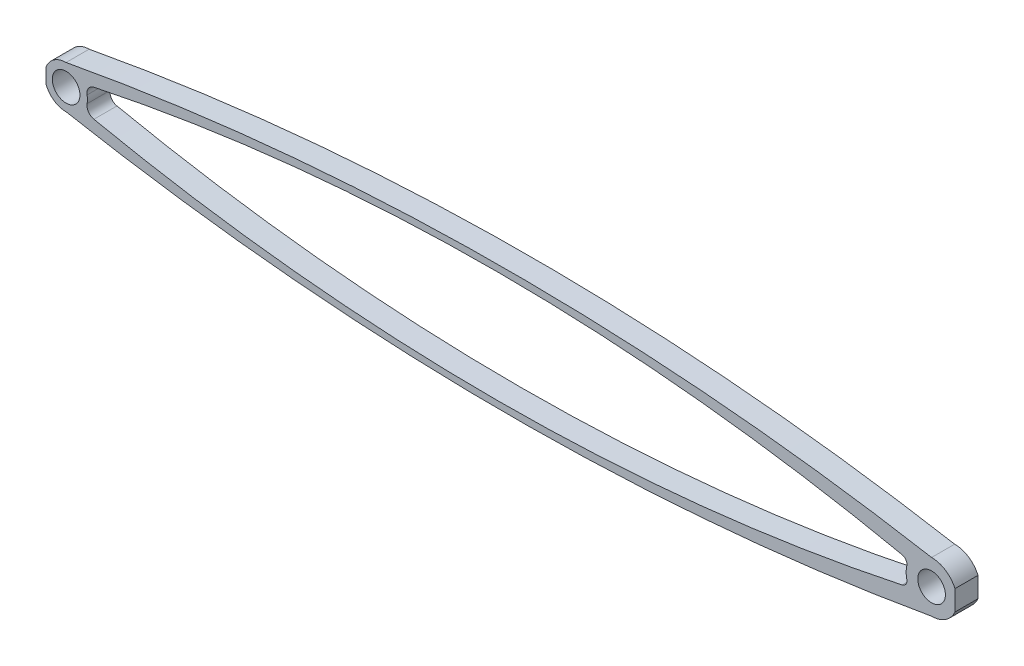
ISO-10303-21;
HEADER;
FILE_DESCRIPTION(('STEP AP214'),'2;1');
FILE_NAME('part.step','',(''),(''),'','','');
FILE_SCHEMA(('AUTOMOTIVE_DESIGN { 1 0 10303 214 1 1 1 1 }'));
ENDSEC;
DATA;
#1=APPLICATION_CONTEXT('core data for automotive mechanical design processes');
#2=APPLICATION_PROTOCOL_DEFINITION('international standard','automotive_design',2000,#1);
#3=PRODUCT_CONTEXT('',#1,'mechanical');
#4=PRODUCT('Part','Part','',(#3));
#5=PRODUCT_RELATED_PRODUCT_CATEGORY('part','',(#4));
#6=PRODUCT_DEFINITION_FORMATION('','',#4);
#7=PRODUCT_DEFINITION_CONTEXT('part definition',#1,'design');
#8=PRODUCT_DEFINITION('design','',#6,#7);
#9=PRODUCT_DEFINITION_SHAPE('','',#8);
#10=(LENGTH_UNIT() NAMED_UNIT(*) SI_UNIT(.MILLI.,.METRE.));
#11=(NAMED_UNIT(*) PLANE_ANGLE_UNIT() SI_UNIT($,.RADIAN.));
#12=(NAMED_UNIT(*) SI_UNIT($,.STERADIAN.) SOLID_ANGLE_UNIT());
#13=UNCERTAINTY_MEASURE_WITH_UNIT(LENGTH_MEASURE(1.E-05),#10,'distance_accuracy_value','');
#14=(GEOMETRIC_REPRESENTATION_CONTEXT(3) GLOBAL_UNCERTAINTY_ASSIGNED_CONTEXT((#13)) GLOBAL_UNIT_ASSIGNED_CONTEXT((#10,
#11,#12)) REPRESENTATION_CONTEXT('',''));
#15=CARTESIAN_POINT('',(0.,0.,0.));
#16=DIRECTION('',(0.,0.,1.));
#17=DIRECTION('',(1.,0.,0.));
#18=AXIS2_PLACEMENT_3D('',#15,#16,#17);
#19=CARTESIAN_POINT('',(0.,0.,5.));
#20=DIRECTION('',(0.,0.,1.));
#21=DIRECTION('',(1.,0.,0.));
#22=AXIS2_PLACEMENT_3D('',#19,#20,#21);
#23=PLANE('',#22);
#24=CARTESIAN_POINT('',(181.075647956683,-1.53844641665199,5.));
#25=DIRECTION('',(0.,0.,1.));
#26=DIRECTION('',(1.,0.,0.));
#27=AXIS2_PLACEMENT_3D('',#24,#25,#26);
#28=CIRCLE('',#27,1.33882745908539);
#29=CARTESIAN_POINT('',(181.3534915169,-2.84812650020144,5.));
#30=VERTEX_POINT('',#29);
#31=CARTESIAN_POINT('',(182.380388165267,-1.23825988579893,5.));
#32=VERTEX_POINT('',#31);
#33=EDGE_CURVE('E226',#30,#32,#28,.T.);
#34=ORIENTED_EDGE('',*,*,#33,.F.);
#35=CARTESIAN_POINT('',(93.3034744992683,412.196057190972,5.));
#36=DIRECTION('',(0.,0.,1.));
#37=DIRECTION('',(1.,0.,0.));
#38=AXIS2_PLACEMENT_3D('',#35,#36,#37);
#39=CIRCLE('',#38,424.281133109496);
#40=CARTESIAN_POINT('',(6.03518102050062,-3.01319712061177,5.));
#41=VERTEX_POINT('',#40);
#42=EDGE_CURVE('E224',#30,#41,#39,.F.);
#43=ORIENTED_EDGE('',*,*,#42,.T.);
#44=CARTESIAN_POINT('',(6.42461858925253,-1.16031245796236,5.));
#45=DIRECTION('',(0.,0.,1.));
#46=DIRECTION('',(1.,0.,0.));
#47=AXIS2_PLACEMENT_3D('',#44,#45,#46);
#48=CIRCLE('',#47,1.89336821380188);
#49=CARTESIAN_POINT('',(4.56139373102548,-0.823806409400569,5.));
#50=VERTEX_POINT('',#49);
#51=EDGE_CURVE('E221',#50,#41,#48,.T.);
#52=ORIENTED_EDGE('',*,*,#51,.F.);
#53=CARTESIAN_POINT('',(0.,0.,5.));
#54=DIRECTION('',(0.,0.,1.));
#55=DIRECTION('',(1.,0.,0.));
#56=AXIS2_PLACEMENT_3D('',#53,#54,#55);
#57=CIRCLE('',#56,4.63518821296482);
#58=CARTESIAN_POINT('',(4.56139373102548,0.823806409400569,5.));
#59=VERTEX_POINT('',#58);
#60=EDGE_CURVE('E219',#50,#59,#57,.T.);
#61=ORIENTED_EDGE('',*,*,#60,.T.);
#62=CARTESIAN_POINT('',(6.42461858925253,1.16031245796236,5.));
#63=DIRECTION('',(0.,0.,1.));
#64=DIRECTION('',(1.,0.,0.));
#65=AXIS2_PLACEMENT_3D('',#62,#63,#64);
#66=CIRCLE('',#65,1.89336821380188);
#67=CARTESIAN_POINT('',(6.03518102050062,3.01319712061177,5.));
#68=VERTEX_POINT('',#67);
#69=EDGE_CURVE('E217',#59,#68,#66,.F.);
#70=ORIENTED_EDGE('',*,*,#69,.T.);
#71=CARTESIAN_POINT('',(93.3034744992683,-412.196057190972,5.));
#72=DIRECTION('',(0.,0.,1.));
#73=DIRECTION('',(1.,0.,0.));
#74=AXIS2_PLACEMENT_3D('',#71,#72,#73);
#75=CIRCLE('',#74,424.281133109496);
#76=CARTESIAN_POINT('',(181.3534915169,2.84812650020144,5.));
#77=VERTEX_POINT('',#76);
#78=EDGE_CURVE('E214',#77,#68,#75,.T.);
#79=ORIENTED_EDGE('',*,*,#78,.F.);
#80=CARTESIAN_POINT('',(181.075647956683,1.53844641665199,5.));
#81=DIRECTION('',(0.,0.,1.));
#82=DIRECTION('',(1.,0.,0.));
#83=AXIS2_PLACEMENT_3D('',#80,#81,#82);
#84=CIRCLE('',#83,1.33882745908539);
#85=CARTESIAN_POINT('',(182.380388165267,1.23825988579893,5.));
#86=VERTEX_POINT('',#85);
#87=EDGE_CURVE('E212',#77,#86,#84,.F.);
#88=ORIENTED_EDGE('',*,*,#87,.T.);
#89=CARTESIAN_POINT('',(187.7624,0.,5.));
#90=DIRECTION('',(0.,0.,1.));
#91=DIRECTION('',(1.,0.,0.));
#92=AXIS2_PLACEMENT_3D('',#89,#90,#91);
#93=CIRCLE('',#92,5.52262065816452);
#94=EDGE_CURVE('E210',#86,#32,#93,.T.);
#95=ORIENTED_EDGE('',*,*,#94,.T.);
#96=EDGE_LOOP('',(#34,#43,#52,#61,#70,#79,#88,#95));
#97=FACE_BOUND('',#96,.T.);
#98=CARTESIAN_POINT('',(0.,0.,5.));
#99=DIRECTION('',(0.,0.,1.));
#100=DIRECTION('',(1.,0.,0.));
#101=AXIS2_PLACEMENT_3D('',#98,#99,#100);
#102=CIRCLE('',#101,3.00000007924961);
#103=CARTESIAN_POINT('',(3.00000007924961,0.,5.));
#104=VERTEX_POINT('',#103);
#105=EDGE_CURVE('E197',#104,#104,#102,.T.);
#106=ORIENTED_EDGE('',*,*,#105,.F.);
#107=EDGE_LOOP('',(#106));
#108=FACE_BOUND('',#107,.T.);
#109=CARTESIAN_POINT('',(187.7624,0.,5.));
#110=DIRECTION('',(0.,0.,1.));
#111=DIRECTION('',(1.,0.,0.));
#112=AXIS2_PLACEMENT_3D('',#109,#110,#111);
#113=CIRCLE('',#112,3.00000007924962);
#114=CARTESIAN_POINT('',(190.76240007925,0.,5.));
#115=VERTEX_POINT('',#114);
#116=EDGE_CURVE('E193',#115,#115,#113,.T.);
#117=ORIENTED_EDGE('',*,*,#116,.F.);
#118=EDGE_LOOP('',(#117));
#119=FACE_BOUND('',#118,.T.);
#120=CARTESIAN_POINT('',(0.,4.63518821296482,5.));
#121=VERTEX_POINT('',#120);
#122=CARTESIAN_POINT('',(-4.35681947691644,1.58211687784739,5.));
#123=VERTEX_POINT('',#122);
#124=EDGE_CURVE('E200',#121,#123,#57,.T.);
#125=ORIENTED_EDGE('',*,*,#124,.T.);
#126=DIRECTION('',(0.,1.,0.));
#127=VECTOR('',#126,1.);
#128=CARTESIAN_POINT('',(-4.35681947691644,0.,5.));
#129=LINE('',#128,#127);
#130=CARTESIAN_POINT('',(-4.35681947691644,-1.58211687784739,5.));
#131=VERTEX_POINT('',#130);
#132=EDGE_CURVE('E148',#131,#123,#129,.T.);
#133=ORIENTED_EDGE('',*,*,#132,.F.);
#134=CARTESIAN_POINT('',(0.,-4.63518821296482,5.));
#135=VERTEX_POINT('',#134);
#136=EDGE_CURVE('E204',#131,#135,#57,.T.);
#137=ORIENTED_EDGE('',*,*,#136,.T.);
#138=CARTESIAN_POINT('',(96.3223446094582,511.41694051381,5.));
#139=DIRECTION('',(0.,0.,1.));
#140=DIRECTION('',(1.,0.,0.));
#141=AXIS2_PLACEMENT_3D('',#138,#139,#140);
#142=CIRCLE('',#141,524.964564170286);
#143=CARTESIAN_POINT('',(187.7624,-5.52262065816452,5.));
#144=VERTEX_POINT('',#143);
#145=EDGE_CURVE('E206',#144,#135,#142,.F.);
#146=ORIENTED_EDGE('',*,*,#145,.F.);
#147=CARTESIAN_POINT('',(192.829341952088,-2.19668800428204,5.));
#148=VERTEX_POINT('',#147);
#149=EDGE_CURVE('E205',#144,#148,#93,.T.);
#150=ORIENTED_EDGE('',*,*,#149,.T.);
#151=DIRECTION('',(0.,-1.,0.));
#152=VECTOR('',#151,1.);
#153=CARTESIAN_POINT('',(192.829341952088,0.,5.));
#154=LINE('',#153,#152);
#155=CARTESIAN_POINT('',(192.829341952088,2.19668800428204,5.));
#156=VERTEX_POINT('',#155);
#157=EDGE_CURVE('E232',#156,#148,#154,.T.);
#158=ORIENTED_EDGE('',*,*,#157,.F.);
#159=CARTESIAN_POINT('',(187.7624,5.52262065816452,5.));
#160=VERTEX_POINT('',#159);
#161=EDGE_CURVE('E209',#156,#160,#93,.T.);
#162=ORIENTED_EDGE('',*,*,#161,.T.);
#163=CARTESIAN_POINT('',(96.3223446094582,-511.41694051381,5.));
#164=DIRECTION('',(0.,0.,1.));
#165=DIRECTION('',(1.,0.,0.));
#166=AXIS2_PLACEMENT_3D('',#163,#164,#165);
#167=CIRCLE('',#166,524.964564170286);
#168=EDGE_CURVE('E201',#160,#121,#167,.T.);
#169=ORIENTED_EDGE('',*,*,#168,.T.);
#170=EDGE_LOOP('',(#125,#133,#137,#146,#150,#158,#162,#169));
#171=FACE_BOUND('',#170,.T.);
#172=ADVANCED_FACE('F36',(#97,#108,#119,#171),#23,.T.);
#173=CARTESIAN_POINT('',(0.,0.,0.));
#174=DIRECTION('',(0.,0.,1.));
#175=DIRECTION('',(1.,0.,0.));
#176=AXIS2_PLACEMENT_3D('',#173,#174,#175);
#177=PLANE('',#176);
#178=CARTESIAN_POINT('',(181.075647956683,-1.53844641665199,0.));
#179=DIRECTION('',(0.,0.,1.));
#180=DIRECTION('',(1.,0.,0.));
#181=AXIS2_PLACEMENT_3D('',#178,#179,#180);
#182=CIRCLE('',#181,1.33882745908539);
#183=CARTESIAN_POINT('',(181.3534915169,-2.84812650020144,0.));
#184=VERTEX_POINT('',#183);
#185=CARTESIAN_POINT('',(182.380388165267,-1.23825988579893,0.));
#186=VERTEX_POINT('',#185);
#187=EDGE_CURVE('E188',#184,#186,#182,.T.);
#188=ORIENTED_EDGE('',*,*,#187,.T.);
#189=CARTESIAN_POINT('',(187.7624,0.,0.));
#190=DIRECTION('',(0.,0.,1.));
#191=DIRECTION('',(1.,0.,0.));
#192=AXIS2_PLACEMENT_3D('',#189,#190,#191);
#193=CIRCLE('',#192,5.52262065816452);
#194=CARTESIAN_POINT('',(182.380388165267,1.23825988579893,0.));
#195=VERTEX_POINT('',#194);
#196=EDGE_CURVE('E291',#195,#186,#193,.T.);
#197=ORIENTED_EDGE('',*,*,#196,.F.);
#198=CARTESIAN_POINT('',(181.075647956683,1.53844641665199,0.));
#199=DIRECTION('',(0.,0.,1.));
#200=DIRECTION('',(1.,0.,0.));
#201=AXIS2_PLACEMENT_3D('',#198,#199,#200);
#202=CIRCLE('',#201,1.33882745908539);
#203=CARTESIAN_POINT('',(181.3534915169,2.84812650020144,0.));
#204=VERTEX_POINT('',#203);
#205=EDGE_CURVE('E296',#204,#195,#202,.F.);
#206=ORIENTED_EDGE('',*,*,#205,.F.);
#207=CARTESIAN_POINT('',(93.3034744992683,-412.196057190972,0.));
#208=DIRECTION('',(0.,0.,1.));
#209=DIRECTION('',(1.,0.,0.));
#210=AXIS2_PLACEMENT_3D('',#207,#208,#209);
#211=CIRCLE('',#210,424.281133109496);
#212=CARTESIAN_POINT('',(6.03518102050062,3.01319712061177,0.));
#213=VERTEX_POINT('',#212);
#214=EDGE_CURVE('E181',#204,#213,#211,.T.);
#215=ORIENTED_EDGE('',*,*,#214,.T.);
#216=CARTESIAN_POINT('',(6.42461858925253,1.16031245796236,0.));
#217=DIRECTION('',(0.,0.,1.));
#218=DIRECTION('',(1.,0.,0.));
#219=AXIS2_PLACEMENT_3D('',#216,#217,#218);
#220=CIRCLE('',#219,1.89336821380188);
#221=CARTESIAN_POINT('',(4.56139373102548,0.823806409400569,0.));
#222=VERTEX_POINT('',#221);
#223=EDGE_CURVE('E174',#222,#213,#220,.F.);
#224=ORIENTED_EDGE('',*,*,#223,.F.);
#225=CARTESIAN_POINT('',(0.,0.,0.));
#226=DIRECTION('',(0.,0.,1.));
#227=DIRECTION('',(1.,0.,0.));
#228=AXIS2_PLACEMENT_3D('',#225,#226,#227);
#229=CIRCLE('',#228,4.63518821296482);
#230=CARTESIAN_POINT('',(4.56139373102548,-0.823806409400569,0.));
#231=VERTEX_POINT('',#230);
#232=EDGE_CURVE('E167',#231,#222,#229,.T.);
#233=ORIENTED_EDGE('',*,*,#232,.F.);
#234=CARTESIAN_POINT('',(6.42461858925253,-1.16031245796236,0.));
#235=DIRECTION('',(0.,0.,1.));
#236=DIRECTION('',(1.,0.,0.));
#237=AXIS2_PLACEMENT_3D('',#234,#235,#236);
#238=CIRCLE('',#237,1.89336821380188);
#239=CARTESIAN_POINT('',(6.03518102050062,-3.01319712061177,0.));
#240=VERTEX_POINT('',#239);
#241=EDGE_CURVE('E175',#231,#240,#238,.T.);
#242=ORIENTED_EDGE('',*,*,#241,.T.);
#243=CARTESIAN_POINT('',(93.3034744992683,412.196057190972,0.));
#244=DIRECTION('',(0.,0.,1.));
#245=DIRECTION('',(1.,0.,0.));
#246=AXIS2_PLACEMENT_3D('',#243,#244,#245);
#247=CIRCLE('',#246,424.281133109496);
#248=EDGE_CURVE('E183',#184,#240,#247,.F.);
#249=ORIENTED_EDGE('',*,*,#248,.F.);
#250=EDGE_LOOP('',(#188,#197,#206,#215,#224,#233,#242,#249));
#251=FACE_BOUND('',#250,.T.);
#252=CARTESIAN_POINT('',(0.,0.,0.));
#253=DIRECTION('',(0.,0.,1.));
#254=DIRECTION('',(1.,0.,0.));
#255=AXIS2_PLACEMENT_3D('',#252,#253,#254);
#256=CIRCLE('',#255,3.00000007924961);
#257=CARTESIAN_POINT('',(3.00000007924961,0.,0.));
#258=VERTEX_POINT('',#257);
#259=EDGE_CURVE('E165',#258,#258,#256,.T.);
#260=ORIENTED_EDGE('',*,*,#259,.T.);
#261=EDGE_LOOP('',(#260));
#262=FACE_BOUND('',#261,.T.);
#263=CARTESIAN_POINT('',(187.7624,0.,0.));
#264=DIRECTION('',(0.,0.,1.));
#265=DIRECTION('',(1.,0.,0.));
#266=AXIS2_PLACEMENT_3D('',#263,#264,#265);
#267=CIRCLE('',#266,3.00000007924962);
#268=CARTESIAN_POINT('',(190.76240007925,0.,0.));
#269=VERTEX_POINT('',#268);
#270=EDGE_CURVE('E169',#269,#269,#267,.T.);
#271=ORIENTED_EDGE('',*,*,#270,.T.);
#272=EDGE_LOOP('',(#271));
#273=FACE_BOUND('',#272,.T.);
#274=DIRECTION('',(0.,1.,0.));
#275=VECTOR('',#274,1.);
#276=CARTESIAN_POINT('',(-4.35681947691644,0.,0.));
#277=LINE('',#276,#275);
#278=CARTESIAN_POINT('',(-4.35681947691644,-1.58211687784739,0.));
#279=VERTEX_POINT('',#278);
#280=CARTESIAN_POINT('',(-4.35681947691644,1.58211687784739,0.));
#281=VERTEX_POINT('',#280);
#282=EDGE_CURVE('E50',#279,#281,#277,.T.);
#283=ORIENTED_EDGE('',*,*,#282,.T.);
#284=CARTESIAN_POINT('',(0.,4.63518821296482,0.));
#285=VERTEX_POINT('',#284);
#286=EDGE_CURVE('E156',#285,#281,#229,.T.);
#287=ORIENTED_EDGE('',*,*,#286,.F.);
#288=CARTESIAN_POINT('',(96.3223446094582,-511.41694051381,0.));
#289=DIRECTION('',(0.,0.,1.));
#290=DIRECTION('',(1.,0.,0.));
#291=AXIS2_PLACEMENT_3D('',#288,#289,#290);
#292=CIRCLE('',#291,524.964564170286);
#293=CARTESIAN_POINT('',(187.7624,5.52262065816452,0.));
#294=VERTEX_POINT('',#293);
#295=EDGE_CURVE('E171',#294,#285,#292,.T.);
#296=ORIENTED_EDGE('',*,*,#295,.F.);
#297=CARTESIAN_POINT('',(192.829341952088,2.19668800428204,0.));
#298=VERTEX_POINT('',#297);
#299=EDGE_CURVE('E256',#298,#294,#193,.T.);
#300=ORIENTED_EDGE('',*,*,#299,.F.);
#301=DIRECTION('',(0.,1.,0.));
#302=VECTOR('',#301,1.);
#303=CARTESIAN_POINT('',(192.829341952088,0.,0.));
#304=LINE('',#303,#302);
#305=CARTESIAN_POINT('',(192.829341952088,-2.19668800428204,0.));
#306=VERTEX_POINT('',#305);
#307=EDGE_CURVE('E259',#306,#298,#304,.T.);
#308=ORIENTED_EDGE('',*,*,#307,.F.);
#309=CARTESIAN_POINT('',(187.7624,-5.52262065816452,0.));
#310=VERTEX_POINT('',#309);
#311=EDGE_CURVE('E246',#310,#306,#193,.T.);
#312=ORIENTED_EDGE('',*,*,#311,.F.);
#313=CARTESIAN_POINT('',(96.3223446094582,511.41694051381,0.));
#314=DIRECTION('',(0.,0.,1.));
#315=DIRECTION('',(1.,0.,0.));
#316=AXIS2_PLACEMENT_3D('',#313,#314,#315);
#317=CIRCLE('',#316,524.964564170286);
#318=CARTESIAN_POINT('',(0.,-4.63518821296482,0.));
#319=VERTEX_POINT('',#318);
#320=EDGE_CURVE('E289',#310,#319,#317,.F.);
#321=ORIENTED_EDGE('',*,*,#320,.T.);
#322=EDGE_CURVE('E159',#279,#319,#229,.T.);
#323=ORIENTED_EDGE('',*,*,#322,.F.);
#324=EDGE_LOOP('',(#283,#287,#296,#300,#308,#312,#321,#323));
#325=FACE_BOUND('',#324,.T.);
#326=ADVANCED_FACE('F154',(#251,#262,#273,#325),#177,.F.);
#327=CARTESIAN_POINT('',(0.,0.,5.));
#328=DIRECTION('',(0.,0.,-1.));
#329=DIRECTION('',(-1.,0.,0.));
#330=AXIS2_PLACEMENT_3D('',#327,#328,#329);
#331=CYLINDRICAL_SURFACE('',#330,4.63518821296482);
#332=DIRECTION('',(0.,0.,-1.));
#333=VECTOR('',#332,1.);
#334=CARTESIAN_POINT('',(-4.35681947691644,1.58211687784739,5.));
#335=LINE('',#334,#333);
#336=EDGE_CURVE('E11',#123,#281,#335,.T.);
#337=ORIENTED_EDGE('',*,*,#336,.F.);
#338=ORIENTED_EDGE('',*,*,#124,.F.);
#339=DIRECTION('',(0.,0.,-1.));
#340=VECTOR('',#339,1.);
#341=CARTESIAN_POINT('',(0.,4.63518821296482,5.));
#342=LINE('',#341,#340);
#343=EDGE_CURVE('E163',#121,#285,#342,.T.);
#344=ORIENTED_EDGE('',*,*,#343,.T.);
#345=ORIENTED_EDGE('',*,*,#286,.T.);
#346=EDGE_LOOP('',(#337,#338,#344,#345));
#347=FACE_BOUND('',#346,.T.);
#348=ADVANCED_FACE('F161',(#347),#331,.T.);
#349=DIRECTION('',(0.,0.,-1.));
#350=VECTOR('',#349,1.);
#351=CARTESIAN_POINT('',(-4.35681947691644,-1.58211687784739,5.));
#352=LINE('',#351,#350);
#353=EDGE_CURVE('E44',#279,#131,#352,.F.);
#354=ORIENTED_EDGE('',*,*,#353,.F.);
#355=ORIENTED_EDGE('',*,*,#322,.T.);
#356=DIRECTION('',(0.,0.,-1.));
#357=VECTOR('',#356,1.);
#358=CARTESIAN_POINT('',(0.,-4.63518821296482,5.));
#359=LINE('',#358,#357);
#360=EDGE_CURVE('E261',#135,#319,#359,.T.);
#361=ORIENTED_EDGE('',*,*,#360,.F.);
#362=ORIENTED_EDGE('',*,*,#136,.F.);
#363=EDGE_LOOP('',(#354,#355,#361,#362));
#364=FACE_BOUND('',#363,.T.);
#365=ADVANCED_FACE('F284',(#364),#331,.T.);
#366=CARTESIAN_POINT('',(187.7624,0.,5.));
#367=DIRECTION('',(0.,0.,-1.));
#368=DIRECTION('',(-1.,0.,0.));
#369=AXIS2_PLACEMENT_3D('',#366,#367,#368);
#370=CYLINDRICAL_SURFACE('',#369,5.52262065816452);
#371=DIRECTION('',(0.,0.,-1.));
#372=VECTOR('',#371,1.);
#373=CARTESIAN_POINT('',(192.829341952088,-2.19668800428204,5.));
#374=LINE('',#373,#372);
#375=EDGE_CURVE('E58',#148,#306,#374,.T.);
#376=ORIENTED_EDGE('',*,*,#375,.F.);
#377=ORIENTED_EDGE('',*,*,#149,.F.);
#378=DIRECTION('',(0.,0.,-1.));
#379=VECTOR('',#378,1.);
#380=CARTESIAN_POINT('',(187.7624,-5.52262065816452,5.));
#381=LINE('',#380,#379);
#382=EDGE_CURVE('E257',#144,#310,#381,.T.);
#383=ORIENTED_EDGE('',*,*,#382,.T.);
#384=ORIENTED_EDGE('',*,*,#311,.T.);
#385=EDGE_LOOP('',(#376,#377,#383,#384));
#386=FACE_BOUND('',#385,.T.);
#387=ADVANCED_FACE('F243',(#386),#370,.T.);
#388=DIRECTION('',(0.,0.,-1.));
#389=VECTOR('',#388,1.);
#390=CARTESIAN_POINT('',(192.829341952088,2.19668800428204,5.));
#391=LINE('',#390,#389);
#392=EDGE_CURVE('E230',#298,#156,#391,.F.);
#393=ORIENTED_EDGE('',*,*,#392,.F.);
#394=ORIENTED_EDGE('',*,*,#299,.T.);
#395=DIRECTION('',(0.,0.,-1.));
#396=VECTOR('',#395,1.);
#397=CARTESIAN_POINT('',(187.7624,5.52262065816452,5.));
#398=LINE('',#397,#396);
#399=EDGE_CURVE('E253',#160,#294,#398,.T.);
#400=ORIENTED_EDGE('',*,*,#399,.F.);
#401=ORIENTED_EDGE('',*,*,#161,.F.);
#402=EDGE_LOOP('',(#393,#394,#400,#401));
#403=FACE_BOUND('',#402,.T.);
#404=ADVANCED_FACE('F254',(#403),#370,.T.);
#405=CARTESIAN_POINT('',(96.3223446094582,511.41694051381,5.));
#406=DIRECTION('',(0.,0.,-1.));
#407=DIRECTION('',(-1.,0.,0.));
#408=AXIS2_PLACEMENT_3D('',#405,#406,#407);
#409=CYLINDRICAL_SURFACE('',#408,524.964564170286);
#410=ORIENTED_EDGE('',*,*,#320,.F.);
#411=ORIENTED_EDGE('',*,*,#382,.F.);
#412=ORIENTED_EDGE('',*,*,#145,.T.);
#413=ORIENTED_EDGE('',*,*,#360,.T.);
#414=EDGE_LOOP('',(#410,#411,#412,#413));
#415=FACE_BOUND('',#414,.T.);
#416=ADVANCED_FACE('F288',(#415),#409,.T.);
#417=CARTESIAN_POINT('',(96.3223446094582,-511.41694051381,5.));
#418=DIRECTION('',(0.,0.,-1.));
#419=DIRECTION('',(-1.,0.,0.));
#420=AXIS2_PLACEMENT_3D('',#417,#418,#419);
#421=CYLINDRICAL_SURFACE('',#420,524.964564170286);
#422=ORIENTED_EDGE('',*,*,#295,.T.);
#423=ORIENTED_EDGE('',*,*,#343,.F.);
#424=ORIENTED_EDGE('',*,*,#168,.F.);
#425=ORIENTED_EDGE('',*,*,#399,.T.);
#426=EDGE_LOOP('',(#422,#423,#424,#425));
#427=FACE_BOUND('',#426,.T.);
#428=ADVANCED_FACE('F252',(#427),#421,.T.);
#429=CARTESIAN_POINT('',(181.075647956683,-1.53844641665199,5.));
#430=DIRECTION('',(0.,0.,-1.));
#431=DIRECTION('',(-1.,0.,0.));
#432=AXIS2_PLACEMENT_3D('',#429,#430,#431);
#433=CYLINDRICAL_SURFACE('',#432,1.33882745908539);
#434=ORIENTED_EDGE('',*,*,#187,.F.);
#435=DIRECTION('',(0.,0.,-1.));
#436=VECTOR('',#435,1.);
#437=CARTESIAN_POINT('',(181.3534915169,-2.84812650020144,5.));
#438=LINE('',#437,#436);
#439=EDGE_CURVE('E279',#30,#184,#438,.T.);
#440=ORIENTED_EDGE('',*,*,#439,.F.);
#441=ORIENTED_EDGE('',*,*,#33,.T.);
#442=DIRECTION('',(0.,0.,-1.));
#443=VECTOR('',#442,1.);
#444=CARTESIAN_POINT('',(182.380388165267,-1.23825988579893,5.));
#445=LINE('',#444,#443);
#446=EDGE_CURVE('E196',#32,#186,#445,.T.);
#447=ORIENTED_EDGE('',*,*,#446,.T.);
#448=EDGE_LOOP('',(#434,#440,#441,#447));
#449=FACE_BOUND('',#448,.T.);
#450=ADVANCED_FACE('F38',(#449),#433,.F.);
#451=CARTESIAN_POINT('',(93.3034744992683,412.196057190972,5.));
#452=DIRECTION('',(0.,0.,-1.));
#453=DIRECTION('',(-1.,0.,0.));
#454=AXIS2_PLACEMENT_3D('',#451,#452,#453);
#455=CYLINDRICAL_SURFACE('',#454,424.281133109496);
#456=ORIENTED_EDGE('',*,*,#248,.T.);
#457=DIRECTION('',(0.,0.,-1.));
#458=VECTOR('',#457,1.);
#459=CARTESIAN_POINT('',(6.03518102050062,-3.01319712061177,5.));
#460=LINE('',#459,#458);
#461=EDGE_CURVE('E277',#41,#240,#460,.T.);
#462=ORIENTED_EDGE('',*,*,#461,.F.);
#463=ORIENTED_EDGE('',*,*,#42,.F.);
#464=ORIENTED_EDGE('',*,*,#439,.T.);
#465=EDGE_LOOP('',(#456,#462,#463,#464));
#466=FACE_BOUND('',#465,.T.);
#467=ADVANCED_FACE('F327',(#466),#455,.F.);
#468=CARTESIAN_POINT('',(6.42461858925253,-1.16031245796236,5.));
#469=DIRECTION('',(0.,0.,-1.));
#470=DIRECTION('',(-1.,0.,0.));
#471=AXIS2_PLACEMENT_3D('',#468,#469,#470);
#472=CYLINDRICAL_SURFACE('',#471,1.89336821380188);
#473=ORIENTED_EDGE('',*,*,#241,.F.);
#474=DIRECTION('',(0.,0.,-1.));
#475=VECTOR('',#474,1.);
#476=CARTESIAN_POINT('',(4.56139373102548,-0.823806409400569,5.));
#477=LINE('',#476,#475);
#478=EDGE_CURVE('E275',#50,#231,#477,.T.);
#479=ORIENTED_EDGE('',*,*,#478,.F.);
#480=ORIENTED_EDGE('',*,*,#51,.T.);
#481=ORIENTED_EDGE('',*,*,#461,.T.);
#482=EDGE_LOOP('',(#473,#479,#480,#481));
#483=FACE_BOUND('',#482,.T.);
#484=ADVANCED_FACE('F325',(#483),#472,.F.);
#485=ORIENTED_EDGE('',*,*,#232,.T.);
#486=DIRECTION('',(0.,0.,-1.));
#487=VECTOR('',#486,1.);
#488=CARTESIAN_POINT('',(4.56139373102548,0.823806409400569,5.));
#489=LINE('',#488,#487);
#490=EDGE_CURVE('E273',#59,#222,#489,.T.);
#491=ORIENTED_EDGE('',*,*,#490,.F.);
#492=ORIENTED_EDGE('',*,*,#60,.F.);
#493=ORIENTED_EDGE('',*,*,#478,.T.);
#494=EDGE_LOOP('',(#485,#491,#492,#493));
#495=FACE_BOUND('',#494,.T.);
#496=ADVANCED_FACE('F317',(#495),#331,.T.);
#497=CARTESIAN_POINT('',(6.42461858925253,1.16031245796236,5.));
#498=DIRECTION('',(0.,0.,-1.));
#499=DIRECTION('',(-1.,0.,0.));
#500=AXIS2_PLACEMENT_3D('',#497,#498,#499);
#501=CYLINDRICAL_SURFACE('',#500,1.89336821380188);
#502=ORIENTED_EDGE('',*,*,#223,.T.);
#503=DIRECTION('',(0.,0.,-1.));
#504=VECTOR('',#503,1.);
#505=CARTESIAN_POINT('',(6.03518102050062,3.01319712061177,5.));
#506=LINE('',#505,#504);
#507=EDGE_CURVE('E271',#68,#213,#506,.T.);
#508=ORIENTED_EDGE('',*,*,#507,.F.);
#509=ORIENTED_EDGE('',*,*,#69,.F.);
#510=ORIENTED_EDGE('',*,*,#490,.T.);
#511=EDGE_LOOP('',(#502,#508,#509,#510));
#512=FACE_BOUND('',#511,.T.);
#513=ADVANCED_FACE('F315',(#512),#501,.F.);
#514=CARTESIAN_POINT('',(93.3034744992683,-412.196057190972,5.));
#515=DIRECTION('',(0.,0.,-1.));
#516=DIRECTION('',(-1.,0.,0.));
#517=AXIS2_PLACEMENT_3D('',#514,#515,#516);
#518=CYLINDRICAL_SURFACE('',#517,424.281133109496);
#519=ORIENTED_EDGE('',*,*,#214,.F.);
#520=DIRECTION('',(0.,0.,-1.));
#521=VECTOR('',#520,1.);
#522=CARTESIAN_POINT('',(181.3534915169,2.84812650020144,5.));
#523=LINE('',#522,#521);
#524=EDGE_CURVE('E269',#77,#204,#523,.T.);
#525=ORIENTED_EDGE('',*,*,#524,.F.);
#526=ORIENTED_EDGE('',*,*,#78,.T.);
#527=ORIENTED_EDGE('',*,*,#507,.T.);
#528=EDGE_LOOP('',(#519,#525,#526,#527));
#529=FACE_BOUND('',#528,.T.);
#530=ADVANCED_FACE('F309',(#529),#518,.F.);
#531=CARTESIAN_POINT('',(181.075647956683,1.53844641665199,5.));
#532=DIRECTION('',(0.,0.,-1.));
#533=DIRECTION('',(-1.,0.,0.));
#534=AXIS2_PLACEMENT_3D('',#531,#532,#533);
#535=CYLINDRICAL_SURFACE('',#534,1.33882745908539);
#536=ORIENTED_EDGE('',*,*,#205,.T.);
#537=DIRECTION('',(0.,0.,-1.));
#538=VECTOR('',#537,1.);
#539=CARTESIAN_POINT('',(182.380388165267,1.23825988579893,5.));
#540=LINE('',#539,#538);
#541=EDGE_CURVE('E266',#86,#195,#540,.T.);
#542=ORIENTED_EDGE('',*,*,#541,.F.);
#543=ORIENTED_EDGE('',*,*,#87,.F.);
#544=ORIENTED_EDGE('',*,*,#524,.T.);
#545=EDGE_LOOP('',(#536,#542,#543,#544));
#546=FACE_BOUND('',#545,.T.);
#547=ADVANCED_FACE('F332',(#546),#535,.F.);
#548=CARTESIAN_POINT('',(0.,0.,5.));
#549=DIRECTION('',(0.,0.,-1.));
#550=DIRECTION('',(-1.,0.,0.));
#551=AXIS2_PLACEMENT_3D('',#548,#549,#550);
#552=CYLINDRICAL_SURFACE('',#551,3.00000007924961);
#553=ORIENTED_EDGE('',*,*,#105,.T.);
#554=EDGE_LOOP('',(#553));
#555=FACE_BOUND('',#554,.T.);
#556=ORIENTED_EDGE('',*,*,#259,.F.);
#557=EDGE_LOOP('',(#556));
#558=FACE_BOUND('',#557,.T.);
#559=ADVANCED_FACE('F334',(#555,#558),#552,.F.);
#560=ORIENTED_EDGE('',*,*,#196,.T.);
#561=ORIENTED_EDGE('',*,*,#446,.F.);
#562=ORIENTED_EDGE('',*,*,#94,.F.);
#563=ORIENTED_EDGE('',*,*,#541,.T.);
#564=EDGE_LOOP('',(#560,#561,#562,#563));
#565=FACE_BOUND('',#564,.T.);
#566=ADVANCED_FACE('F331',(#565),#370,.T.);
#567=CARTESIAN_POINT('',(187.7624,0.,5.));
#568=DIRECTION('',(0.,0.,-1.));
#569=DIRECTION('',(-1.,0.,0.));
#570=AXIS2_PLACEMENT_3D('',#567,#568,#569);
#571=CYLINDRICAL_SURFACE('',#570,3.00000007924962);
#572=ORIENTED_EDGE('',*,*,#116,.T.);
#573=EDGE_LOOP('',(#572));
#574=FACE_BOUND('',#573,.T.);
#575=ORIENTED_EDGE('',*,*,#270,.F.);
#576=EDGE_LOOP('',(#575));
#577=FACE_BOUND('',#576,.T.);
#578=ADVANCED_FACE('F353',(#574,#577),#571,.F.);
#579=CARTESIAN_POINT('',(192.829341952088,0.,5.));
#580=DIRECTION('',(1.,0.,0.));
#581=DIRECTION('',(0.,0.,-1.));
#582=AXIS2_PLACEMENT_3D('',#579,#580,#581);
#583=PLANE('',#582);
#584=ORIENTED_EDGE('',*,*,#375,.T.);
#585=ORIENTED_EDGE('',*,*,#307,.T.);
#586=ORIENTED_EDGE('',*,*,#392,.T.);
#587=ORIENTED_EDGE('',*,*,#157,.T.);
#588=EDGE_LOOP('',(#584,#585,#586,#587));
#589=FACE_BOUND('',#588,.T.);
#590=ADVANCED_FACE('F235',(#589),#583,.T.);
#591=CARTESIAN_POINT('',(-4.35681947691644,0.,5.));
#592=DIRECTION('',(-1.,0.,0.));
#593=DIRECTION('',(0.,0.,1.));
#594=AXIS2_PLACEMENT_3D('',#591,#592,#593);
#595=PLANE('',#594);
#596=ORIENTED_EDGE('',*,*,#336,.T.);
#597=ORIENTED_EDGE('',*,*,#282,.F.);
#598=ORIENTED_EDGE('',*,*,#353,.T.);
#599=ORIENTED_EDGE('',*,*,#132,.T.);
#600=EDGE_LOOP('',(#596,#597,#598,#599));
#601=FACE_BOUND('',#600,.T.);
#602=ADVANCED_FACE('F146',(#601),#595,.T.);
#603=CLOSED_SHELL('',(#172,#326,#348,#365,#387,#404,#416,#428,#450,#467,#484,#496,#513,#530,
#547,#559,#566,#578,#590,#602));
#604=MANIFOLD_SOLID_BREP('B2',#603);
#605=ADVANCED_BREP_SHAPE_REPRESENTATION('',(#18,#604),#14);
#606=SHAPE_DEFINITION_REPRESENTATION(#9,#605);
ENDSEC;
END-ISO-10303-21;
